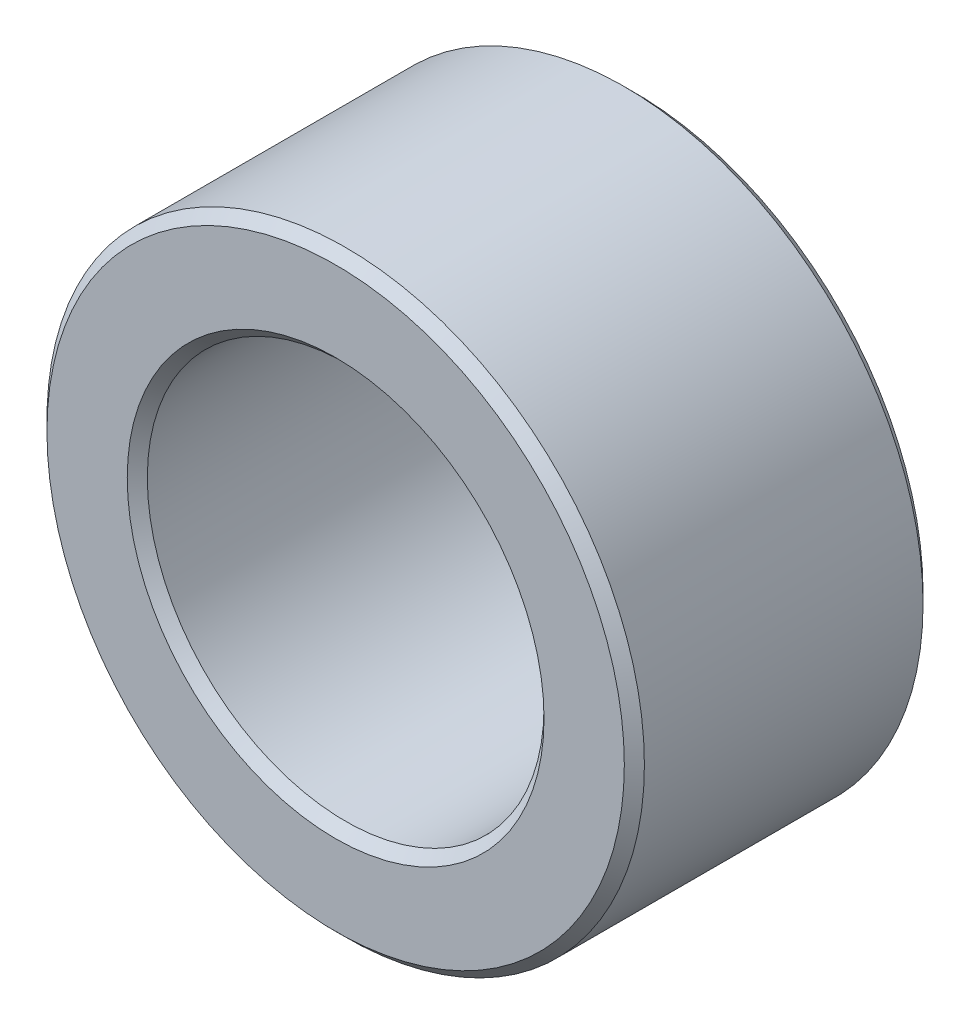
ISO-10303-21;
HEADER;
FILE_DESCRIPTION(('STEP AP214'),'2;1');
FILE_NAME('part.step','',(''),(''),'','','');
FILE_SCHEMA(('AUTOMOTIVE_DESIGN { 1 0 10303 214 1 1 1 1 }'));
ENDSEC;
DATA;
#1=APPLICATION_CONTEXT('core data for automotive mechanical design processes');
#2=APPLICATION_PROTOCOL_DEFINITION('international standard','automotive_design',2000,#1);
#3=PRODUCT_CONTEXT('',#1,'mechanical');
#4=PRODUCT('Part','Part','',(#3));
#5=PRODUCT_RELATED_PRODUCT_CATEGORY('part','',(#4));
#6=PRODUCT_DEFINITION_FORMATION('','',#4);
#7=PRODUCT_DEFINITION_CONTEXT('part definition',#1,'design');
#8=PRODUCT_DEFINITION('design','',#6,#7);
#9=PRODUCT_DEFINITION_SHAPE('','',#8);
#10=(LENGTH_UNIT() NAMED_UNIT(*) SI_UNIT(.MILLI.,.METRE.));
#11=(NAMED_UNIT(*) PLANE_ANGLE_UNIT() SI_UNIT($,.RADIAN.));
#12=(NAMED_UNIT(*) SI_UNIT($,.STERADIAN.) SOLID_ANGLE_UNIT());
#13=UNCERTAINTY_MEASURE_WITH_UNIT(LENGTH_MEASURE(1.E-05),#10,'distance_accuracy_value','');
#14=(GEOMETRIC_REPRESENTATION_CONTEXT(3) GLOBAL_UNCERTAINTY_ASSIGNED_CONTEXT((#13)) GLOBAL_UNIT_ASSIGNED_CONTEXT((#10,
#11,#12)) REPRESENTATION_CONTEXT('',''));
#15=CARTESIAN_POINT('',(0.,0.,0.));
#16=DIRECTION('',(0.,0.,1.));
#17=DIRECTION('',(1.,0.,0.));
#18=AXIS2_PLACEMENT_3D('',#15,#16,#17);
#19=CARTESIAN_POINT('',(0.,0.,-1.5875));
#20=DIRECTION('',(0.,0.,1.));
#21=DIRECTION('',(1.,0.,0.));
#22=AXIS2_PLACEMENT_3D('',#19,#20,#21);
#23=CYLINDRICAL_SURFACE('',#22,3.175);
#24=CARTESIAN_POINT('',(0.,0.,1.48082));
#25=DIRECTION('',(0.,0.,1.));
#26=DIRECTION('',(1.,0.,0.));
#27=AXIS2_PLACEMENT_3D('',#24,#25,#26);
#28=CIRCLE('',#27,3.175);
#29=CARTESIAN_POINT('',(3.175,0.,1.48082));
#30=VERTEX_POINT('',#29);
#31=EDGE_CURVE('E59',#30,#30,#28,.F.);
#32=ORIENTED_EDGE('',*,*,#31,.T.);
#33=EDGE_LOOP('',(#32));
#34=FACE_BOUND('',#33,.T.);
#35=CARTESIAN_POINT('',(0.,0.,-1.48082));
#36=DIRECTION('',(0.,0.,1.));
#37=DIRECTION('',(1.,0.,0.));
#38=AXIS2_PLACEMENT_3D('',#35,#36,#37);
#39=CIRCLE('',#38,3.175);
#40=CARTESIAN_POINT('',(3.175,0.,-1.48082));
#41=VERTEX_POINT('',#40);
#42=EDGE_CURVE('E62',#41,#41,#39,.T.);
#43=ORIENTED_EDGE('',*,*,#42,.T.);
#44=EDGE_LOOP('',(#43));
#45=FACE_BOUND('',#44,.T.);
#46=ADVANCED_FACE('F39',(#34,#45),#23,.T.);
#47=CARTESIAN_POINT('',(0.,0.,-1.5875));
#48=DIRECTION('',(0.,0.,1.));
#49=DIRECTION('',(1.,0.,0.));
#50=AXIS2_PLACEMENT_3D('',#47,#48,#49);
#51=PLANE('',#50);
#52=CARTESIAN_POINT('',(0.,0.,-1.5875));
#53=DIRECTION('',(0.,0.,1.));
#54=DIRECTION('',(1.,0.,0.));
#55=AXIS2_PLACEMENT_3D('',#52,#53,#54);
#56=CIRCLE('',#55,3.06832);
#57=CARTESIAN_POINT('',(3.06832,0.,-1.5875));
#58=VERTEX_POINT('',#57);
#59=EDGE_CURVE('E50',#58,#58,#56,.F.);
#60=ORIENTED_EDGE('',*,*,#59,.T.);
#61=EDGE_LOOP('',(#60));
#62=FACE_BOUND('',#61,.T.);
#63=CARTESIAN_POINT('',(0.,0.,-1.5875));
#64=DIRECTION('',(0.,0.,1.));
#65=DIRECTION('',(1.,0.,0.));
#66=AXIS2_PLACEMENT_3D('',#63,#64,#65);
#67=CIRCLE('',#66,2.21488);
#68=CARTESIAN_POINT('',(2.21488,0.,-1.5875));
#69=VERTEX_POINT('',#68);
#70=EDGE_CURVE('E54',#69,#69,#67,.T.);
#71=ORIENTED_EDGE('',*,*,#70,.T.);
#72=EDGE_LOOP('',(#71));
#73=FACE_BOUND('',#72,.T.);
#74=ADVANCED_FACE('F87',(#62,#73),#51,.F.);
#75=CARTESIAN_POINT('',(0.,0.,-1.5875));
#76=DIRECTION('',(0.,0.,1.));
#77=DIRECTION('',(1.,0.,0.));
#78=AXIS2_PLACEMENT_3D('',#75,#76,#77);
#79=CYLINDRICAL_SURFACE('',#78,2.1082);
#80=CARTESIAN_POINT('',(0.,0.,1.48082));
#81=DIRECTION('',(0.,0.,1.));
#82=DIRECTION('',(1.,0.,0.));
#83=AXIS2_PLACEMENT_3D('',#80,#81,#82);
#84=CIRCLE('',#83,2.1082);
#85=CARTESIAN_POINT('',(2.1082,0.,1.48082));
#86=VERTEX_POINT('',#85);
#87=EDGE_CURVE('E10',#86,#86,#84,.T.);
#88=ORIENTED_EDGE('',*,*,#87,.T.);
#89=EDGE_LOOP('',(#88));
#90=FACE_BOUND('',#89,.T.);
#91=CARTESIAN_POINT('',(0.,0.,-1.48082));
#92=DIRECTION('',(0.,0.,1.));
#93=DIRECTION('',(1.,0.,0.));
#94=AXIS2_PLACEMENT_3D('',#91,#92,#93);
#95=CIRCLE('',#94,2.1082);
#96=CARTESIAN_POINT('',(2.1082,0.,-1.48082));
#97=VERTEX_POINT('',#96);
#98=EDGE_CURVE('E46',#97,#97,#95,.F.);
#99=ORIENTED_EDGE('',*,*,#98,.T.);
#100=EDGE_LOOP('',(#99));
#101=FACE_BOUND('',#100,.T.);
#102=ADVANCED_FACE('F93',(#90,#101),#79,.F.);
#103=CARTESIAN_POINT('',(0.,0.,1.5875));
#104=DIRECTION('',(0.,0.,1.));
#105=DIRECTION('',(1.,0.,0.));
#106=AXIS2_PLACEMENT_3D('',#103,#104,#105);
#107=PLANE('',#106);
#108=CARTESIAN_POINT('',(0.,0.,1.5875));
#109=DIRECTION('',(0.,0.,1.));
#110=DIRECTION('',(1.,0.,0.));
#111=AXIS2_PLACEMENT_3D('',#108,#109,#110);
#112=CIRCLE('',#111,3.06832);
#113=CARTESIAN_POINT('',(3.06832,0.,1.5875));
#114=VERTEX_POINT('',#113);
#115=EDGE_CURVE('E65',#114,#114,#112,.T.);
#116=ORIENTED_EDGE('',*,*,#115,.T.);
#117=EDGE_LOOP('',(#116));
#118=FACE_BOUND('',#117,.T.);
#119=CARTESIAN_POINT('',(0.,0.,1.5875));
#120=DIRECTION('',(0.,0.,1.));
#121=DIRECTION('',(1.,0.,0.));
#122=AXIS2_PLACEMENT_3D('',#119,#120,#121);
#123=CIRCLE('',#122,2.21488);
#124=CARTESIAN_POINT('',(2.21488,0.,1.5875));
#125=VERTEX_POINT('',#124);
#126=EDGE_CURVE('E68',#125,#125,#123,.F.);
#127=ORIENTED_EDGE('',*,*,#126,.T.);
#128=EDGE_LOOP('',(#127));
#129=FACE_BOUND('',#128,.T.);
#130=ADVANCED_FACE('F72',(#118,#129),#107,.T.);
#131=CARTESIAN_POINT('',(0.,0.,1.5875));
#132=DIRECTION('',(0.,0.,-1.));
#133=DIRECTION('',(-1.,0.,0.));
#134=AXIS2_PLACEMENT_3D('',#131,#132,#133);
#135=CONICAL_SURFACE('',#134,3.06832,0.785398163397448);
#136=ORIENTED_EDGE('',*,*,#31,.F.);
#137=EDGE_LOOP('',(#136));
#138=FACE_BOUND('',#137,.T.);
#139=ORIENTED_EDGE('',*,*,#115,.F.);
#140=EDGE_LOOP('',(#139));
#141=FACE_BOUND('',#140,.T.);
#142=ADVANCED_FACE('F83',(#138,#141),#135,.T.);
#143=CARTESIAN_POINT('',(0.,0.,-1.48082));
#144=DIRECTION('',(0.,0.,1.));
#145=DIRECTION('',(1.,0.,0.));
#146=AXIS2_PLACEMENT_3D('',#143,#144,#145);
#147=CONICAL_SURFACE('',#146,3.175,0.785398163397456);
#148=ORIENTED_EDGE('',*,*,#59,.F.);
#149=EDGE_LOOP('',(#148));
#150=FACE_BOUND('',#149,.T.);
#151=ORIENTED_EDGE('',*,*,#42,.F.);
#152=EDGE_LOOP('',(#151));
#153=FACE_BOUND('',#152,.T.);
#154=ADVANCED_FACE('F77',(#150,#153),#147,.T.);
#155=CARTESIAN_POINT('',(0.,0.,1.48082));
#156=DIRECTION('',(0.,0.,1.));
#157=DIRECTION('',(1.,0.,0.));
#158=AXIS2_PLACEMENT_3D('',#155,#156,#157);
#159=CONICAL_SURFACE('',#158,2.1082,0.78539816339745);
#160=ORIENTED_EDGE('',*,*,#126,.F.);
#161=EDGE_LOOP('',(#160));
#162=FACE_BOUND('',#161,.T.);
#163=ORIENTED_EDGE('',*,*,#87,.F.);
#164=EDGE_LOOP('',(#163));
#165=FACE_BOUND('',#164,.T.);
#166=ADVANCED_FACE('F74',(#162,#165),#159,.F.);
#167=CARTESIAN_POINT('',(0.,0.,-1.5875));
#168=DIRECTION('',(0.,0.,-1.));
#169=DIRECTION('',(-1.,0.,0.));
#170=AXIS2_PLACEMENT_3D('',#167,#168,#169);
#171=CONICAL_SURFACE('',#170,2.21488,0.785398163397446);
#172=ORIENTED_EDGE('',*,*,#98,.F.);
#173=EDGE_LOOP('',(#172));
#174=FACE_BOUND('',#173,.T.);
#175=ORIENTED_EDGE('',*,*,#70,.F.);
#176=EDGE_LOOP('',(#175));
#177=FACE_BOUND('',#176,.T.);
#178=ADVANCED_FACE('F41',(#174,#177),#171,.F.);
#179=CLOSED_SHELL('',(#46,#74,#102,#130,#142,#154,#166,#178));
#180=MANIFOLD_SOLID_BREP('B2',#179);
#181=ADVANCED_BREP_SHAPE_REPRESENTATION('',(#18,#180),#14);
#182=SHAPE_DEFINITION_REPRESENTATION(#9,#181);
ENDSEC;
END-ISO-10303-21;
